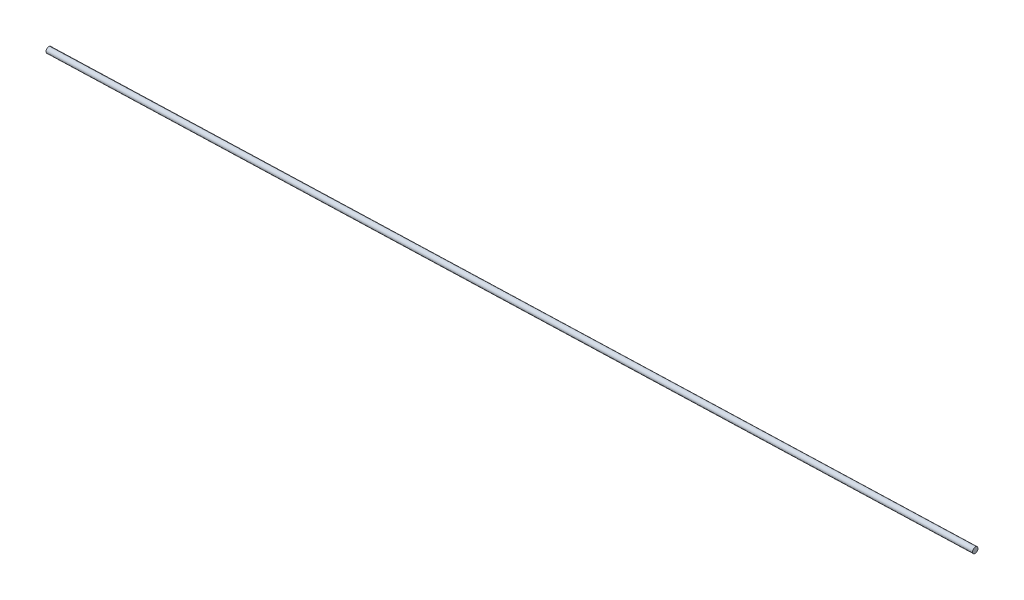
ISO-10303-21;
HEADER;
FILE_DESCRIPTION(('STEP AP214'),'2;1');
FILE_NAME('part.step','',(''),(''),'','','');
FILE_SCHEMA(('AUTOMOTIVE_DESIGN { 1 0 10303 214 1 1 1 1 }'));
ENDSEC;
DATA;
#1=APPLICATION_CONTEXT('core data for automotive mechanical design processes');
#2=APPLICATION_PROTOCOL_DEFINITION('international standard','automotive_design',2000,#1);
#3=PRODUCT_CONTEXT('',#1,'mechanical');
#4=PRODUCT('Part','Part','',(#3));
#5=PRODUCT_RELATED_PRODUCT_CATEGORY('part','',(#4));
#6=PRODUCT_DEFINITION_FORMATION('','',#4);
#7=PRODUCT_DEFINITION_CONTEXT('part definition',#1,'design');
#8=PRODUCT_DEFINITION('design','',#6,#7);
#9=PRODUCT_DEFINITION_SHAPE('','',#8);
#10=(LENGTH_UNIT() NAMED_UNIT(*) SI_UNIT(.MILLI.,.METRE.));
#11=(NAMED_UNIT(*) PLANE_ANGLE_UNIT() SI_UNIT($,.RADIAN.));
#12=(NAMED_UNIT(*) SI_UNIT($,.STERADIAN.) SOLID_ANGLE_UNIT());
#13=UNCERTAINTY_MEASURE_WITH_UNIT(LENGTH_MEASURE(1.E-05),#10,'distance_accuracy_value','');
#14=(GEOMETRIC_REPRESENTATION_CONTEXT(3) GLOBAL_UNCERTAINTY_ASSIGNED_CONTEXT((#13)) GLOBAL_UNIT_ASSIGNED_CONTEXT((#10,
#11,#12)) REPRESENTATION_CONTEXT('',''));
#15=CARTESIAN_POINT('',(0.,0.,0.));
#16=DIRECTION('',(0.,0.,1.));
#17=DIRECTION('',(1.,0.,0.));
#18=AXIS2_PLACEMENT_3D('',#15,#16,#17);
#19=CARTESIAN_POINT('',(-2620.12153819252,0.824419309715149,90.7120403866085));
#20=DIRECTION('',(0.999429326306551,-0.000314889657842992,-0.0337775452473624));
#21=DIRECTION('',(-0.0337775469219771,0.,-0.99942937585601));
#22=AXIS2_PLACEMENT_3D('',#19,#20,#21);
#23=CYLINDRICAL_SURFACE('',#22,3.175);
#24=CARTESIAN_POINT('',(-2620.12153819252,0.824419309715149,90.7120403866085));
#25=DIRECTION('',(-0.999429326306551,0.000314889657842992,0.0337775452473624));
#26=DIRECTION('',(0.0337775469219771,0.,0.99942937585601));
#27=AXIS2_PLACEMENT_3D('',#24,#25,#26);
#28=CIRCLE('',#27,3.175);
#29=CARTESIAN_POINT('',(-2620.01429448104,0.824419309715149,93.8852286549514));
#30=VERTEX_POINT('',#29);
#31=EDGE_CURVE('E10',#30,#30,#28,.T.);
#32=ORIENTED_EDGE('',*,*,#31,.F.);
#33=EDGE_LOOP('',(#32));
#34=FACE_BOUND('',#33,.T.);
#35=CARTESIAN_POINT('',(-1604.70134266506,0.50449141734667,56.3940544152883));
#36=DIRECTION('',(-0.999429326306551,0.000314889657842992,0.0337775452473624));
#37=DIRECTION('',(0.0337775469219771,0.,0.99942937585601));
#38=AXIS2_PLACEMENT_3D('',#35,#36,#37);
#39=CIRCLE('',#38,3.175);
#40=CARTESIAN_POINT('',(-1604.59409895359,0.50449141734667,59.5672426836312));
#41=VERTEX_POINT('',#40);
#42=EDGE_CURVE('E40',#41,#41,#39,.T.);
#43=ORIENTED_EDGE('',*,*,#42,.T.);
#44=EDGE_LOOP('',(#43));
#45=FACE_BOUND('',#44,.T.);
#46=ADVANCED_FACE('F37',(#34,#45),#23,.T.);
#47=CARTESIAN_POINT('',(-2620.12153819252,0.824419309715149,90.7120403866085));
#48=DIRECTION('',(-0.999429326306551,0.000314889657842992,0.0337775452473624));
#49=DIRECTION('',(0.0337775469219771,0.,0.99942937585601));
#50=AXIS2_PLACEMENT_3D('',#47,#48,#49);
#51=PLANE('',#50);
#52=ORIENTED_EDGE('',*,*,#31,.T.);
#53=EDGE_LOOP('',(#52));
#54=FACE_BOUND('',#53,.T.);
#55=ADVANCED_FACE('F53',(#54),#51,.T.);
#56=CARTESIAN_POINT('',(-1604.70134266506,0.50449141734667,56.3940544152883));
#57=DIRECTION('',(-0.999429326306551,0.000314889657842992,0.0337775452473624));
#58=DIRECTION('',(0.0337775469219771,0.,0.99942937585601));
#59=AXIS2_PLACEMENT_3D('',#56,#57,#58);
#60=PLANE('',#59);
#61=ORIENTED_EDGE('',*,*,#42,.F.);
#62=EDGE_LOOP('',(#61));
#63=FACE_BOUND('',#62,.T.);
#64=ADVANCED_FACE('F51',(#63),#60,.F.);
#65=CLOSED_SHELL('',(#46,#55,#64));
#66=MANIFOLD_SOLID_BREP('B2',#65);
#67=ADVANCED_BREP_SHAPE_REPRESENTATION('',(#18,#66),#14);
#68=SHAPE_DEFINITION_REPRESENTATION(#9,#67);
ENDSEC;
END-ISO-10303-21;
